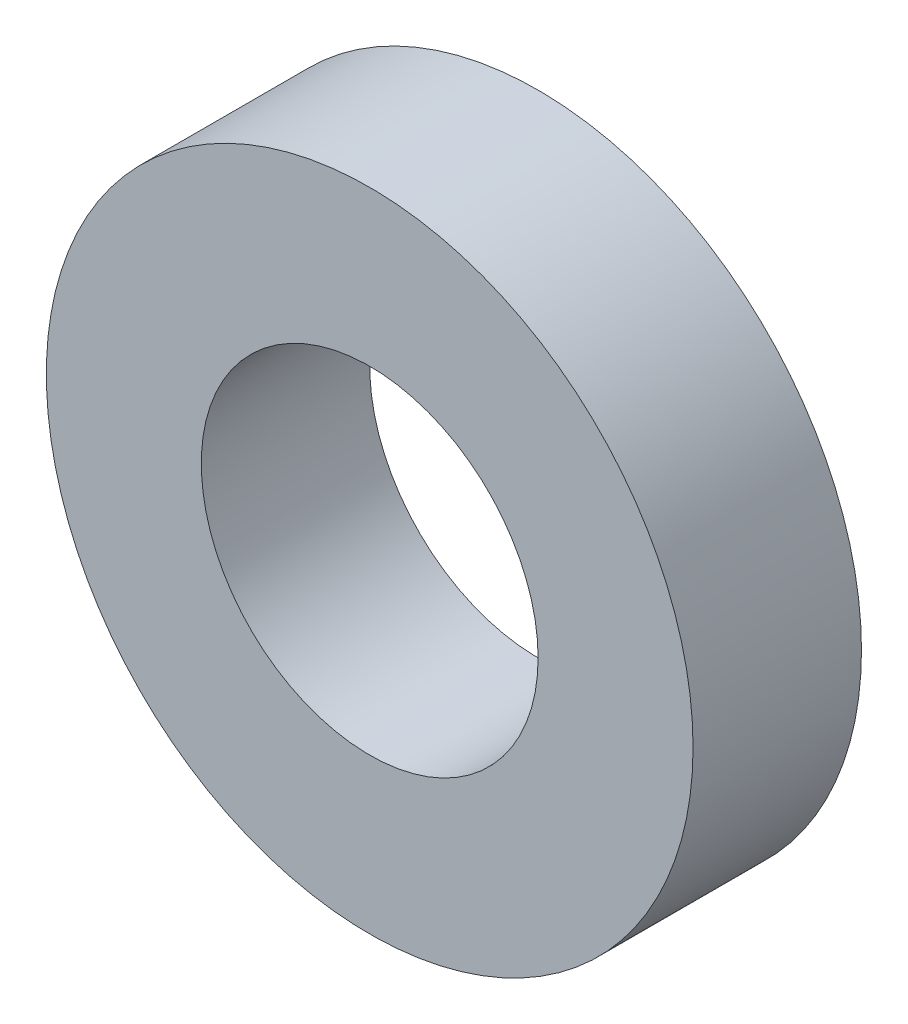
ISO-10303-21;
HEADER;
FILE_DESCRIPTION(('STEP AP214'),'2;1');
FILE_NAME('part.step','',(''),(''),'','','');
FILE_SCHEMA(('AUTOMOTIVE_DESIGN { 1 0 10303 214 1 1 1 1 }'));
ENDSEC;
DATA;
#1=APPLICATION_CONTEXT('core data for automotive mechanical design processes');
#2=APPLICATION_PROTOCOL_DEFINITION('international standard','automotive_design',2000,#1);
#3=PRODUCT_CONTEXT('',#1,'mechanical');
#4=PRODUCT('Part','Part','',(#3));
#5=PRODUCT_RELATED_PRODUCT_CATEGORY('part','',(#4));
#6=PRODUCT_DEFINITION_FORMATION('','',#4);
#7=PRODUCT_DEFINITION_CONTEXT('part definition',#1,'design');
#8=PRODUCT_DEFINITION('design','',#6,#7);
#9=PRODUCT_DEFINITION_SHAPE('','',#8);
#10=(LENGTH_UNIT() NAMED_UNIT(*) SI_UNIT(.MILLI.,.METRE.));
#11=(NAMED_UNIT(*) PLANE_ANGLE_UNIT() SI_UNIT($,.RADIAN.));
#12=(NAMED_UNIT(*) SI_UNIT($,.STERADIAN.) SOLID_ANGLE_UNIT());
#13=UNCERTAINTY_MEASURE_WITH_UNIT(LENGTH_MEASURE(1.E-05),#10,'distance_accuracy_value','');
#14=(GEOMETRIC_REPRESENTATION_CONTEXT(3) GLOBAL_UNCERTAINTY_ASSIGNED_CONTEXT((#13)) GLOBAL_UNIT_ASSIGNED_CONTEXT((#10,
#11,#12)) REPRESENTATION_CONTEXT('',''));
#15=CARTESIAN_POINT('',(0.,0.,0.));
#16=DIRECTION('',(0.,0.,1.));
#17=DIRECTION('',(1.,0.,0.));
#18=AXIS2_PLACEMENT_3D('',#15,#16,#17);
#19=CARTESIAN_POINT('',(0.,0.,5.));
#20=DIRECTION('',(0.,0.,-1.));
#21=DIRECTION('',(-1.,0.,0.));
#22=AXIS2_PLACEMENT_3D('',#19,#20,#21);
#23=CYLINDRICAL_SURFACE('',#22,9.6);
#24=CARTESIAN_POINT('',(0.,0.,5.));
#25=DIRECTION('',(0.,0.,1.));
#26=DIRECTION('',(1.,0.,0.));
#27=AXIS2_PLACEMENT_3D('',#24,#25,#26);
#28=CIRCLE('',#27,9.6);
#29=CARTESIAN_POINT('',(9.6,0.,5.));
#30=VERTEX_POINT('',#29);
#31=EDGE_CURVE('E10',#30,#30,#28,.T.);
#32=ORIENTED_EDGE('',*,*,#31,.F.);
#33=EDGE_LOOP('',(#32));
#34=FACE_BOUND('',#33,.T.);
#35=CARTESIAN_POINT('',(0.,0.,0.));
#36=DIRECTION('',(0.,0.,1.));
#37=DIRECTION('',(1.,0.,0.));
#38=AXIS2_PLACEMENT_3D('',#35,#36,#37);
#39=CIRCLE('',#38,9.6);
#40=CARTESIAN_POINT('',(9.6,0.,0.));
#41=VERTEX_POINT('',#40);
#42=EDGE_CURVE('E44',#41,#41,#39,.T.);
#43=ORIENTED_EDGE('',*,*,#42,.T.);
#44=EDGE_LOOP('',(#43));
#45=FACE_BOUND('',#44,.T.);
#46=ADVANCED_FACE('F41',(#34,#45),#23,.T.);
#47=CARTESIAN_POINT('',(0.,0.,5.));
#48=DIRECTION('',(0.,0.,1.));
#49=DIRECTION('',(1.,0.,0.));
#50=AXIS2_PLACEMENT_3D('',#47,#48,#49);
#51=PLANE('',#50);
#52=CARTESIAN_POINT('',(0.,0.,5.));
#53=DIRECTION('',(0.,0.,1.));
#54=DIRECTION('',(1.,0.,0.));
#55=AXIS2_PLACEMENT_3D('',#52,#53,#54);
#56=CIRCLE('',#55,5.);
#57=CARTESIAN_POINT('',(5.,0.,5.));
#58=VERTEX_POINT('',#57);
#59=EDGE_CURVE('E55',#58,#58,#56,.T.);
#60=ORIENTED_EDGE('',*,*,#59,.F.);
#61=EDGE_LOOP('',(#60));
#62=FACE_BOUND('',#61,.T.);
#63=ORIENTED_EDGE('',*,*,#31,.T.);
#64=EDGE_LOOP('',(#63));
#65=FACE_BOUND('',#64,.T.);
#66=ADVANCED_FACE('F72',(#62,#65),#51,.T.);
#67=CARTESIAN_POINT('',(0.,0.,0.));
#68=DIRECTION('',(0.,0.,1.));
#69=DIRECTION('',(1.,0.,0.));
#70=AXIS2_PLACEMENT_3D('',#67,#68,#69);
#71=PLANE('',#70);
#72=CARTESIAN_POINT('',(0.,0.,0.));
#73=DIRECTION('',(0.,0.,1.));
#74=DIRECTION('',(1.,0.,0.));
#75=AXIS2_PLACEMENT_3D('',#72,#73,#74);
#76=CIRCLE('',#75,5.);
#77=CARTESIAN_POINT('',(5.,0.,0.));
#78=VERTEX_POINT('',#77);
#79=EDGE_CURVE('E53',#78,#78,#76,.T.);
#80=ORIENTED_EDGE('',*,*,#79,.T.);
#81=EDGE_LOOP('',(#80));
#82=FACE_BOUND('',#81,.T.);
#83=ORIENTED_EDGE('',*,*,#42,.F.);
#84=EDGE_LOOP('',(#83));
#85=FACE_BOUND('',#84,.T.);
#86=ADVANCED_FACE('F63',(#82,#85),#71,.F.);
#87=CARTESIAN_POINT('',(0.,0.,0.));
#88=DIRECTION('',(0.,0.,1.));
#89=DIRECTION('',(1.,0.,0.));
#90=AXIS2_PLACEMENT_3D('',#87,#88,#89);
#91=CYLINDRICAL_SURFACE('',#90,5.);
#92=ORIENTED_EDGE('',*,*,#79,.F.);
#93=EDGE_LOOP('',(#92));
#94=FACE_BOUND('',#93,.T.);
#95=ORIENTED_EDGE('',*,*,#59,.T.);
#96=EDGE_LOOP('',(#95));
#97=FACE_BOUND('',#96,.T.);
#98=ADVANCED_FACE('F66',(#94,#97),#91,.F.);
#99=CLOSED_SHELL('',(#46,#66,#86,#98));
#100=MANIFOLD_SOLID_BREP('B2',#99);
#101=ADVANCED_BREP_SHAPE_REPRESENTATION('',(#18,#100),#14);
#102=SHAPE_DEFINITION_REPRESENTATION(#9,#101);
ENDSEC;
END-ISO-10303-21;
